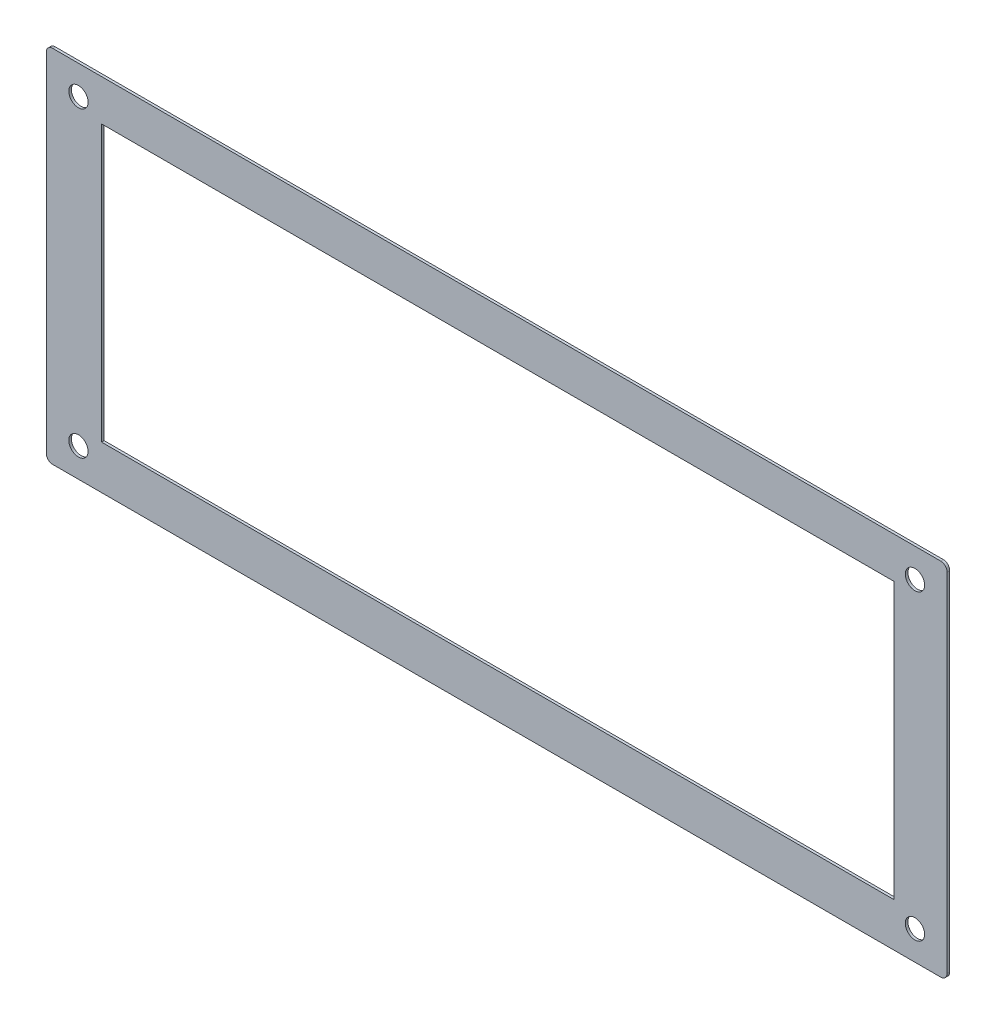
ISO-10303-21;
HEADER;
FILE_DESCRIPTION(('STEP AP214'),'2;1');
FILE_NAME('part.step','',(''),(''),'','','');
FILE_SCHEMA(('AUTOMOTIVE_DESIGN { 1 0 10303 214 1 1 1 1 }'));
ENDSEC;
DATA;
#1=APPLICATION_CONTEXT('core data for automotive mechanical design processes');
#2=APPLICATION_PROTOCOL_DEFINITION('international standard','automotive_design',2000,#1);
#3=PRODUCT_CONTEXT('',#1,'mechanical');
#4=PRODUCT('Part','Part','',(#3));
#5=PRODUCT_RELATED_PRODUCT_CATEGORY('part','',(#4));
#6=PRODUCT_DEFINITION_FORMATION('','',#4);
#7=PRODUCT_DEFINITION_CONTEXT('part definition',#1,'design');
#8=PRODUCT_DEFINITION('design','',#6,#7);
#9=PRODUCT_DEFINITION_SHAPE('','',#8);
#10=(LENGTH_UNIT() NAMED_UNIT(*) SI_UNIT(.MILLI.,.METRE.));
#11=(NAMED_UNIT(*) PLANE_ANGLE_UNIT() SI_UNIT($,.RADIAN.));
#12=(NAMED_UNIT(*) SI_UNIT($,.STERADIAN.) SOLID_ANGLE_UNIT());
#13=UNCERTAINTY_MEASURE_WITH_UNIT(LENGTH_MEASURE(1.E-05),#10,'distance_accuracy_value','');
#14=(GEOMETRIC_REPRESENTATION_CONTEXT(3) GLOBAL_UNCERTAINTY_ASSIGNED_CONTEXT((#13)) GLOBAL_UNIT_ASSIGNED_CONTEXT((#10,
#11,#12)) REPRESENTATION_CONTEXT('',''));
#15=CARTESIAN_POINT('',(0.,0.,0.));
#16=DIRECTION('',(0.,0.,1.));
#17=DIRECTION('',(1.,0.,0.));
#18=AXIS2_PLACEMENT_3D('',#15,#16,#17);
#19=CARTESIAN_POINT('',(1.,55.,-0.4));
#20=DIRECTION('',(0.,0.,1.));
#21=DIRECTION('',(1.,0.,0.));
#22=AXIS2_PLACEMENT_3D('',#19,#20,#21);
#23=CYLINDRICAL_SURFACE('',#22,1.);
#24=CARTESIAN_POINT('',(1.,55.,0.));
#25=DIRECTION('',(0.,0.,1.));
#26=DIRECTION('',(1.,0.,0.));
#27=AXIS2_PLACEMENT_3D('',#24,#25,#26);
#28=CIRCLE('',#27,1.);
#29=CARTESIAN_POINT('',(0.,55.,0.));
#30=VERTEX_POINT('',#29);
#31=CARTESIAN_POINT('',(1.00000000000001,56.,0.));
#32=VERTEX_POINT('',#31);
#33=EDGE_CURVE('E184',#30,#32,#28,.F.);
#34=ORIENTED_EDGE('',*,*,#33,.T.);
#35=DIRECTION('',(0.,0.,1.));
#36=VECTOR('',#35,1.);
#37=CARTESIAN_POINT('',(1.00000000000001,56.,-0.4));
#38=LINE('',#37,#36);
#39=CARTESIAN_POINT('',(1.00000000000001,56.,-0.4));
#40=VERTEX_POINT('',#39);
#41=EDGE_CURVE('E11',#40,#32,#38,.T.);
#42=ORIENTED_EDGE('',*,*,#41,.F.);
#43=CARTESIAN_POINT('',(1.,55.,-0.4));
#44=DIRECTION('',(0.,0.,1.));
#45=DIRECTION('',(1.,0.,0.));
#46=AXIS2_PLACEMENT_3D('',#43,#44,#45);
#47=CIRCLE('',#46,1.);
#48=CARTESIAN_POINT('',(0.,55.,-0.4));
#49=VERTEX_POINT('',#48);
#50=EDGE_CURVE('E258',#49,#40,#47,.F.);
#51=ORIENTED_EDGE('',*,*,#50,.F.);
#52=DIRECTION('',(0.,0.,1.));
#53=VECTOR('',#52,1.);
#54=CARTESIAN_POINT('',(0.,55.,-0.4));
#55=LINE('',#54,#53);
#56=EDGE_CURVE('E211',#49,#30,#55,.T.);
#57=ORIENTED_EDGE('',*,*,#56,.T.);
#58=EDGE_LOOP('',(#34,#42,#51,#57));
#59=FACE_BOUND('',#58,.T.);
#60=ADVANCED_FACE('F39',(#59),#23,.T.);
#61=CARTESIAN_POINT('',(0.,56.,-0.4));
#62=DIRECTION('',(0.,-1.,0.));
#63=DIRECTION('',(0.,0.,-1.));
#64=AXIS2_PLACEMENT_3D('',#61,#62,#63);
#65=PLANE('',#64);
#66=DIRECTION('',(1.,0.,0.));
#67=VECTOR('',#66,1.);
#68=CARTESIAN_POINT('',(0.,56.,0.));
#69=LINE('',#68,#67);
#70=CARTESIAN_POINT('',(139.,56.,0.));
#71=VERTEX_POINT('',#70);
#72=EDGE_CURVE('E95',#32,#71,#69,.T.);
#73=ORIENTED_EDGE('',*,*,#72,.T.);
#74=DIRECTION('',(0.,0.,1.));
#75=VECTOR('',#74,1.);
#76=CARTESIAN_POINT('',(139.,56.,-0.4));
#77=LINE('',#76,#75);
#78=CARTESIAN_POINT('',(139.,56.,-0.4));
#79=VERTEX_POINT('',#78);
#80=EDGE_CURVE('E49',#79,#71,#77,.T.);
#81=ORIENTED_EDGE('',*,*,#80,.F.);
#82=DIRECTION('',(1.,0.,0.));
#83=VECTOR('',#82,1.);
#84=CARTESIAN_POINT('',(0.,56.,-0.4));
#85=LINE('',#84,#83);
#86=EDGE_CURVE('E57',#40,#79,#85,.T.);
#87=ORIENTED_EDGE('',*,*,#86,.F.);
#88=ORIENTED_EDGE('',*,*,#41,.T.);
#89=EDGE_LOOP('',(#73,#81,#87,#88));
#90=FACE_BOUND('',#89,.T.);
#91=ADVANCED_FACE('F284',(#90),#65,.F.);
#92=CARTESIAN_POINT('',(139.,55.,-0.4));
#93=DIRECTION('',(0.,0.,1.));
#94=DIRECTION('',(1.,0.,0.));
#95=AXIS2_PLACEMENT_3D('',#92,#93,#94);
#96=CYLINDRICAL_SURFACE('',#95,1.);
#97=CARTESIAN_POINT('',(139.,55.,0.));
#98=DIRECTION('',(0.,0.,1.));
#99=DIRECTION('',(1.,0.,0.));
#100=AXIS2_PLACEMENT_3D('',#97,#98,#99);
#101=CIRCLE('',#100,1.);
#102=CARTESIAN_POINT('',(140.,55.,0.));
#103=VERTEX_POINT('',#102);
#104=EDGE_CURVE('E147',#71,#103,#101,.F.);
#105=ORIENTED_EDGE('',*,*,#104,.T.);
#106=DIRECTION('',(0.,0.,1.));
#107=VECTOR('',#106,1.);
#108=CARTESIAN_POINT('',(140.,55.,-0.4));
#109=LINE('',#108,#107);
#110=CARTESIAN_POINT('',(140.,55.,-0.4));
#111=VERTEX_POINT('',#110);
#112=EDGE_CURVE('E145',#111,#103,#109,.T.);
#113=ORIENTED_EDGE('',*,*,#112,.F.);
#114=CARTESIAN_POINT('',(139.,55.,-0.4));
#115=DIRECTION('',(0.,0.,1.));
#116=DIRECTION('',(1.,0.,0.));
#117=AXIS2_PLACEMENT_3D('',#114,#115,#116);
#118=CIRCLE('',#117,1.);
#119=EDGE_CURVE('E135',#79,#111,#118,.F.);
#120=ORIENTED_EDGE('',*,*,#119,.F.);
#121=ORIENTED_EDGE('',*,*,#80,.T.);
#122=EDGE_LOOP('',(#105,#113,#120,#121));
#123=FACE_BOUND('',#122,.T.);
#124=ADVANCED_FACE('F146',(#123),#96,.T.);
#125=CARTESIAN_POINT('',(140.,0.,-0.4));
#126=DIRECTION('',(1.,0.,0.));
#127=DIRECTION('',(0.,0.,-1.));
#128=AXIS2_PLACEMENT_3D('',#125,#126,#127);
#129=PLANE('',#128);
#130=DIRECTION('',(0.,1.,0.));
#131=VECTOR('',#130,1.);
#132=CARTESIAN_POINT('',(140.,0.,0.));
#133=LINE('',#132,#131);
#134=CARTESIAN_POINT('',(140.,1.00000000000001,0.));
#135=VERTEX_POINT('',#134);
#136=EDGE_CURVE('E197',#135,#103,#133,.T.);
#137=ORIENTED_EDGE('',*,*,#136,.F.);
#138=DIRECTION('',(0.,0.,1.));
#139=VECTOR('',#138,1.);
#140=CARTESIAN_POINT('',(140.,1.00000000000001,-0.4));
#141=LINE('',#140,#139);
#142=CARTESIAN_POINT('',(140.,1.00000000000001,-0.4));
#143=VERTEX_POINT('',#142);
#144=EDGE_CURVE('E151',#143,#135,#141,.T.);
#145=ORIENTED_EDGE('',*,*,#144,.F.);
#146=DIRECTION('',(0.,1.,0.));
#147=VECTOR('',#146,1.);
#148=CARTESIAN_POINT('',(140.,0.,-0.4));
#149=LINE('',#148,#147);
#150=EDGE_CURVE('E140',#143,#111,#149,.T.);
#151=ORIENTED_EDGE('',*,*,#150,.T.);
#152=ORIENTED_EDGE('',*,*,#112,.T.);
#153=EDGE_LOOP('',(#137,#145,#151,#152));
#154=FACE_BOUND('',#153,.T.);
#155=ADVANCED_FACE('F153',(#154),#129,.T.);
#156=CARTESIAN_POINT('',(139.,1.,-0.4));
#157=DIRECTION('',(0.,0.,1.));
#158=DIRECTION('',(1.,0.,0.));
#159=AXIS2_PLACEMENT_3D('',#156,#157,#158);
#160=CYLINDRICAL_SURFACE('',#159,1.);
#161=CARTESIAN_POINT('',(139.,1.,0.));
#162=DIRECTION('',(0.,0.,1.));
#163=DIRECTION('',(1.,0.,0.));
#164=AXIS2_PLACEMENT_3D('',#161,#162,#163);
#165=CIRCLE('',#164,1.);
#166=CARTESIAN_POINT('',(139.,0.,0.));
#167=VERTEX_POINT('',#166);
#168=EDGE_CURVE('E194',#167,#135,#165,.T.);
#169=ORIENTED_EDGE('',*,*,#168,.F.);
#170=DIRECTION('',(0.,0.,1.));
#171=VECTOR('',#170,1.);
#172=CARTESIAN_POINT('',(139.,0.,-0.4));
#173=LINE('',#172,#171);
#174=CARTESIAN_POINT('',(139.,0.,-0.4));
#175=VERTEX_POINT('',#174);
#176=EDGE_CURVE('E204',#175,#167,#173,.T.);
#177=ORIENTED_EDGE('',*,*,#176,.F.);
#178=CARTESIAN_POINT('',(139.,1.,-0.4));
#179=DIRECTION('',(0.,0.,1.));
#180=DIRECTION('',(1.,0.,0.));
#181=AXIS2_PLACEMENT_3D('',#178,#179,#180);
#182=CIRCLE('',#181,1.);
#183=EDGE_CURVE('E154',#175,#143,#182,.T.);
#184=ORIENTED_EDGE('',*,*,#183,.T.);
#185=ORIENTED_EDGE('',*,*,#144,.T.);
#186=EDGE_LOOP('',(#169,#177,#184,#185));
#187=FACE_BOUND('',#186,.T.);
#188=ADVANCED_FACE('F272',(#187),#160,.T.);
#189=CARTESIAN_POINT('',(0.,0.,-0.4));
#190=DIRECTION('',(0.,-1.,0.));
#191=DIRECTION('',(0.,0.,-1.));
#192=AXIS2_PLACEMENT_3D('',#189,#190,#191);
#193=PLANE('',#192);
#194=DIRECTION('',(1.,0.,0.));
#195=VECTOR('',#194,1.);
#196=CARTESIAN_POINT('',(0.,0.,0.));
#197=LINE('',#196,#195);
#198=CARTESIAN_POINT('',(1.00000000000001,0.,0.));
#199=VERTEX_POINT('',#198);
#200=EDGE_CURVE('E191',#199,#167,#197,.T.);
#201=ORIENTED_EDGE('',*,*,#200,.F.);
#202=DIRECTION('',(0.,0.,1.));
#203=VECTOR('',#202,1.);
#204=CARTESIAN_POINT('',(1.00000000000001,0.,-0.4));
#205=LINE('',#204,#203);
#206=CARTESIAN_POINT('',(1.00000000000001,0.,-0.4));
#207=VERTEX_POINT('',#206);
#208=EDGE_CURVE('E206',#207,#199,#205,.T.);
#209=ORIENTED_EDGE('',*,*,#208,.F.);
#210=DIRECTION('',(1.,0.,0.));
#211=VECTOR('',#210,1.);
#212=CARTESIAN_POINT('',(0.,0.,-0.4));
#213=LINE('',#212,#211);
#214=EDGE_CURVE('E156',#207,#175,#213,.T.);
#215=ORIENTED_EDGE('',*,*,#214,.T.);
#216=ORIENTED_EDGE('',*,*,#176,.T.);
#217=EDGE_LOOP('',(#201,#209,#215,#216));
#218=FACE_BOUND('',#217,.T.);
#219=ADVANCED_FACE('F267',(#218),#193,.T.);
#220=CARTESIAN_POINT('',(1.,1.,-0.4));
#221=DIRECTION('',(0.,0.,1.));
#222=DIRECTION('',(1.,0.,0.));
#223=AXIS2_PLACEMENT_3D('',#220,#221,#222);
#224=CYLINDRICAL_SURFACE('',#223,1.);
#225=CARTESIAN_POINT('',(1.,1.,0.));
#226=DIRECTION('',(0.,0.,1.));
#227=DIRECTION('',(1.,0.,0.));
#228=AXIS2_PLACEMENT_3D('',#225,#226,#227);
#229=CIRCLE('',#228,1.);
#230=CARTESIAN_POINT('',(0.,1.00000000000001,0.));
#231=VERTEX_POINT('',#230);
#232=EDGE_CURVE('E189',#199,#231,#229,.F.);
#233=ORIENTED_EDGE('',*,*,#232,.T.);
#234=DIRECTION('',(0.,0.,1.));
#235=VECTOR('',#234,1.);
#236=CARTESIAN_POINT('',(0.,1.00000000000001,-0.4));
#237=LINE('',#236,#235);
#238=CARTESIAN_POINT('',(0.,1.00000000000001,-0.4));
#239=VERTEX_POINT('',#238);
#240=EDGE_CURVE('E208',#239,#231,#237,.T.);
#241=ORIENTED_EDGE('',*,*,#240,.F.);
#242=CARTESIAN_POINT('',(1.,1.,-0.4));
#243=DIRECTION('',(0.,0.,1.));
#244=DIRECTION('',(1.,0.,0.));
#245=AXIS2_PLACEMENT_3D('',#242,#243,#244);
#246=CIRCLE('',#245,1.);
#247=EDGE_CURVE('E262',#207,#239,#246,.F.);
#248=ORIENTED_EDGE('',*,*,#247,.F.);
#249=ORIENTED_EDGE('',*,*,#208,.T.);
#250=EDGE_LOOP('',(#233,#241,#248,#249));
#251=FACE_BOUND('',#250,.T.);
#252=ADVANCED_FACE('F276',(#251),#224,.T.);
#253=CARTESIAN_POINT('',(0.,49.6331800410488,-0.4));
#254=DIRECTION('',(0.,-1.,0.));
#255=DIRECTION('',(0.,0.,-1.));
#256=AXIS2_PLACEMENT_3D('',#253,#254,#255);
#257=PLANE('',#256);
#258=DIRECTION('',(1.,0.,0.));
#259=VECTOR('',#258,1.);
#260=CARTESIAN_POINT('',(0.,49.6331800410488,0.));
#261=LINE('',#260,#259);
#262=CARTESIAN_POINT('',(8.60493923767081,49.6331800410488,0.));
#263=VERTEX_POINT('',#262);
#264=CARTESIAN_POINT('',(131.733794176967,49.6331800410488,0.));
#265=VERTEX_POINT('',#264);
#266=EDGE_CURVE('E161',#263,#265,#261,.T.);
#267=ORIENTED_EDGE('',*,*,#266,.F.);
#268=DIRECTION('',(0.,0.,1.));
#269=VECTOR('',#268,1.);
#270=CARTESIAN_POINT('',(8.60493923767081,49.6331800410488,-0.4));
#271=LINE('',#270,#269);
#272=CARTESIAN_POINT('',(8.60493923767081,49.6331800410488,-0.4));
#273=VERTEX_POINT('',#272);
#274=EDGE_CURVE('E214',#273,#263,#271,.T.);
#275=ORIENTED_EDGE('',*,*,#274,.F.);
#276=DIRECTION('',(1.,0.,0.));
#277=VECTOR('',#276,1.);
#278=CARTESIAN_POINT('',(0.,49.6331800410488,-0.4));
#279=LINE('',#278,#277);
#280=CARTESIAN_POINT('',(131.733794176967,49.6331800410488,-0.4));
#281=VERTEX_POINT('',#280);
#282=EDGE_CURVE('E200',#273,#281,#279,.T.);
#283=ORIENTED_EDGE('',*,*,#282,.T.);
#284=DIRECTION('',(0.,0.,1.));
#285=VECTOR('',#284,1.);
#286=CARTESIAN_POINT('',(131.733794176967,49.6331800410488,-0.4));
#287=LINE('',#286,#285);
#288=EDGE_CURVE('E43',#281,#265,#287,.T.);
#289=ORIENTED_EDGE('',*,*,#288,.T.);
#290=EDGE_LOOP('',(#267,#275,#283,#289));
#291=FACE_BOUND('',#290,.T.);
#292=ADVANCED_FACE('F41',(#291),#257,.T.);
#293=CARTESIAN_POINT('',(8.60493923767081,0.,-0.4));
#294=DIRECTION('',(-1.,0.,0.));
#295=DIRECTION('',(0.,0.,1.));
#296=AXIS2_PLACEMENT_3D('',#293,#294,#295);
#297=PLANE('',#296);
#298=DIRECTION('',(0.,-1.,0.));
#299=VECTOR('',#298,1.);
#300=CARTESIAN_POINT('',(8.60493923767081,0.,0.));
#301=LINE('',#300,#299);
#302=CARTESIAN_POINT('',(8.60493923767081,6.80275118310192,0.));
#303=VERTEX_POINT('',#302);
#304=EDGE_CURVE('E170',#263,#303,#301,.T.);
#305=ORIENTED_EDGE('',*,*,#304,.T.);
#306=DIRECTION('',(0.,0.,1.));
#307=VECTOR('',#306,1.);
#308=CARTESIAN_POINT('',(8.60493923767081,6.80275118310192,-0.4));
#309=LINE('',#308,#307);
#310=CARTESIAN_POINT('',(8.60493923767081,6.80275118310192,-0.4));
#311=VERTEX_POINT('',#310);
#312=EDGE_CURVE('E216',#311,#303,#309,.T.);
#313=ORIENTED_EDGE('',*,*,#312,.F.);
#314=DIRECTION('',(0.,-1.,0.));
#315=VECTOR('',#314,1.);
#316=CARTESIAN_POINT('',(8.60493923767081,0.,-0.4));
#317=LINE('',#316,#315);
#318=EDGE_CURVE('E239',#273,#311,#317,.T.);
#319=ORIENTED_EDGE('',*,*,#318,.F.);
#320=ORIENTED_EDGE('',*,*,#274,.T.);
#321=EDGE_LOOP('',(#305,#313,#319,#320));
#322=FACE_BOUND('',#321,.T.);
#323=ADVANCED_FACE('F232',(#322),#297,.F.);
#324=CARTESIAN_POINT('',(0.,6.80275118310192,-0.4));
#325=DIRECTION('',(0.,-1.,0.));
#326=DIRECTION('',(0.,0.,-1.));
#327=AXIS2_PLACEMENT_3D('',#324,#325,#326);
#328=PLANE('',#327);
#329=DIRECTION('',(1.,0.,0.));
#330=VECTOR('',#329,1.);
#331=CARTESIAN_POINT('',(0.,6.80275118310192,0.));
#332=LINE('',#331,#330);
#333=CARTESIAN_POINT('',(131.733794176967,6.80275118310192,0.));
#334=VERTEX_POINT('',#333);
#335=EDGE_CURVE('E167',#303,#334,#332,.T.);
#336=ORIENTED_EDGE('',*,*,#335,.T.);
#337=DIRECTION('',(0.,0.,1.));
#338=VECTOR('',#337,1.);
#339=CARTESIAN_POINT('',(131.733794176967,6.80275118310192,-0.4));
#340=LINE('',#339,#338);
#341=CARTESIAN_POINT('',(131.733794176967,6.80275118310192,-0.4));
#342=VERTEX_POINT('',#341);
#343=EDGE_CURVE('E218',#342,#334,#340,.T.);
#344=ORIENTED_EDGE('',*,*,#343,.F.);
#345=DIRECTION('',(1.,0.,0.));
#346=VECTOR('',#345,1.);
#347=CARTESIAN_POINT('',(0.,6.80275118310192,-0.4));
#348=LINE('',#347,#346);
#349=EDGE_CURVE('E237',#311,#342,#348,.T.);
#350=ORIENTED_EDGE('',*,*,#349,.F.);
#351=ORIENTED_EDGE('',*,*,#312,.T.);
#352=EDGE_LOOP('',(#336,#344,#350,#351));
#353=FACE_BOUND('',#352,.T.);
#354=ADVANCED_FACE('F236',(#353),#328,.F.);
#355=CARTESIAN_POINT('',(135.,51.5,-0.4));
#356=DIRECTION('',(0.,0.,1.));
#357=DIRECTION('',(1.,0.,0.));
#358=AXIS2_PLACEMENT_3D('',#355,#356,#357);
#359=CYLINDRICAL_SURFACE('',#358,1.50000000000003);
#360=CARTESIAN_POINT('',(135.,51.5,-0.4));
#361=DIRECTION('',(0.,0.,1.));
#362=DIRECTION('',(1.,0.,0.));
#363=AXIS2_PLACEMENT_3D('',#360,#361,#362);
#364=CIRCLE('',#363,1.50000000000003);
#365=CARTESIAN_POINT('',(136.5,51.5,-0.4));
#366=VERTEX_POINT('',#365);
#367=EDGE_CURVE('E255',#366,#366,#364,.T.);
#368=ORIENTED_EDGE('',*,*,#367,.F.);
#369=EDGE_LOOP('',(#368));
#370=FACE_BOUND('',#369,.T.);
#371=CARTESIAN_POINT('',(135.,51.5,0.));
#372=DIRECTION('',(0.,0.,1.));
#373=DIRECTION('',(1.,0.,0.));
#374=AXIS2_PLACEMENT_3D('',#371,#372,#373);
#375=CIRCLE('',#374,1.50000000000003);
#376=CARTESIAN_POINT('',(136.5,51.5,0.));
#377=VERTEX_POINT('',#376);
#378=EDGE_CURVE('E181',#377,#377,#375,.T.);
#379=ORIENTED_EDGE('',*,*,#378,.T.);
#380=EDGE_LOOP('',(#379));
#381=FACE_BOUND('',#380,.T.);
#382=ADVANCED_FACE('F306',(#370,#381),#359,.F.);
#383=CARTESIAN_POINT('',(135.,4.49999999999996,-0.4));
#384=DIRECTION('',(0.,0.,1.));
#385=DIRECTION('',(1.,0.,0.));
#386=AXIS2_PLACEMENT_3D('',#383,#384,#385);
#387=CYLINDRICAL_SURFACE('',#386,1.50000000000003);
#388=CARTESIAN_POINT('',(135.,4.49999999999996,-0.4));
#389=DIRECTION('',(0.,0.,1.));
#390=DIRECTION('',(1.,0.,0.));
#391=AXIS2_PLACEMENT_3D('',#388,#389,#390);
#392=CIRCLE('',#391,1.50000000000003);
#393=CARTESIAN_POINT('',(136.5,4.49999999999996,-0.4));
#394=VERTEX_POINT('',#393);
#395=EDGE_CURVE('E252',#394,#394,#392,.T.);
#396=ORIENTED_EDGE('',*,*,#395,.F.);
#397=EDGE_LOOP('',(#396));
#398=FACE_BOUND('',#397,.T.);
#399=CARTESIAN_POINT('',(135.,4.49999999999996,0.));
#400=DIRECTION('',(0.,0.,1.));
#401=DIRECTION('',(1.,0.,0.));
#402=AXIS2_PLACEMENT_3D('',#399,#400,#401);
#403=CIRCLE('',#402,1.50000000000003);
#404=CARTESIAN_POINT('',(136.5,4.49999999999996,0.));
#405=VERTEX_POINT('',#404);
#406=EDGE_CURVE('E178',#405,#405,#403,.T.);
#407=ORIENTED_EDGE('',*,*,#406,.T.);
#408=EDGE_LOOP('',(#407));
#409=FACE_BOUND('',#408,.T.);
#410=ADVANCED_FACE('F309',(#398,#409),#387,.F.);
#411=CARTESIAN_POINT('',(5.00000000000001,4.50000000000001,-0.4));
#412=DIRECTION('',(0.,0.,1.));
#413=DIRECTION('',(1.,0.,0.));
#414=AXIS2_PLACEMENT_3D('',#411,#412,#413);
#415=CYLINDRICAL_SURFACE('',#414,1.5);
#416=CARTESIAN_POINT('',(5.00000000000001,4.50000000000001,-0.4));
#417=DIRECTION('',(0.,0.,1.));
#418=DIRECTION('',(1.,0.,0.));
#419=AXIS2_PLACEMENT_3D('',#416,#417,#418);
#420=CIRCLE('',#419,1.5);
#421=CARTESIAN_POINT('',(6.50000000000001,4.50000000000001,-0.4));
#422=VERTEX_POINT('',#421);
#423=EDGE_CURVE('E249',#422,#422,#420,.T.);
#424=ORIENTED_EDGE('',*,*,#423,.F.);
#425=EDGE_LOOP('',(#424));
#426=FACE_BOUND('',#425,.T.);
#427=CARTESIAN_POINT('',(5.00000000000001,4.50000000000001,0.));
#428=DIRECTION('',(0.,0.,1.));
#429=DIRECTION('',(1.,0.,0.));
#430=AXIS2_PLACEMENT_3D('',#427,#428,#429);
#431=CIRCLE('',#430,1.5);
#432=CARTESIAN_POINT('',(6.50000000000001,4.50000000000001,0.));
#433=VERTEX_POINT('',#432);
#434=EDGE_CURVE('E175',#433,#433,#431,.T.);
#435=ORIENTED_EDGE('',*,*,#434,.T.);
#436=EDGE_LOOP('',(#435));
#437=FACE_BOUND('',#436,.T.);
#438=ADVANCED_FACE('F313',(#426,#437),#415,.F.);
#439=CARTESIAN_POINT('',(5.00000000000001,51.5,-0.4));
#440=DIRECTION('',(0.,0.,1.));
#441=DIRECTION('',(1.,0.,0.));
#442=AXIS2_PLACEMENT_3D('',#439,#440,#441);
#443=CYLINDRICAL_SURFACE('',#442,1.5);
#444=CARTESIAN_POINT('',(5.00000000000001,51.5,-0.4));
#445=DIRECTION('',(0.,0.,1.));
#446=DIRECTION('',(1.,0.,0.));
#447=AXIS2_PLACEMENT_3D('',#444,#445,#446);
#448=CIRCLE('',#447,1.5);
#449=CARTESIAN_POINT('',(6.50000000000001,51.5,-0.4));
#450=VERTEX_POINT('',#449);
#451=EDGE_CURVE('E242',#450,#450,#448,.T.);
#452=ORIENTED_EDGE('',*,*,#451,.F.);
#453=EDGE_LOOP('',(#452));
#454=FACE_BOUND('',#453,.T.);
#455=CARTESIAN_POINT('',(5.00000000000001,51.5,0.));
#456=DIRECTION('',(0.,0.,1.));
#457=DIRECTION('',(1.,0.,0.));
#458=AXIS2_PLACEMENT_3D('',#455,#456,#457);
#459=CIRCLE('',#458,1.5);
#460=CARTESIAN_POINT('',(6.50000000000001,51.5,0.));
#461=VERTEX_POINT('',#460);
#462=EDGE_CURVE('E172',#461,#461,#459,.T.);
#463=ORIENTED_EDGE('',*,*,#462,.T.);
#464=EDGE_LOOP('',(#463));
#465=FACE_BOUND('',#464,.T.);
#466=ADVANCED_FACE('F317',(#454,#465),#443,.F.);
#467=CARTESIAN_POINT('',(131.733794176967,0.,-0.4));
#468=DIRECTION('',(-1.,0.,0.));
#469=DIRECTION('',(0.,0.,1.));
#470=AXIS2_PLACEMENT_3D('',#467,#468,#469);
#471=PLANE('',#470);
#472=DIRECTION('',(0.,-1.,0.));
#473=VECTOR('',#472,1.);
#474=CARTESIAN_POINT('',(131.733794176967,0.,0.));
#475=LINE('',#474,#473);
#476=EDGE_CURVE('E164',#265,#334,#475,.T.);
#477=ORIENTED_EDGE('',*,*,#476,.F.);
#478=ORIENTED_EDGE('',*,*,#288,.F.);
#479=DIRECTION('',(0.,-1.,0.));
#480=VECTOR('',#479,1.);
#481=CARTESIAN_POINT('',(131.733794176967,0.,-0.4));
#482=LINE('',#481,#480);
#483=EDGE_CURVE('E240',#281,#342,#482,.T.);
#484=ORIENTED_EDGE('',*,*,#483,.T.);
#485=ORIENTED_EDGE('',*,*,#343,.T.);
#486=EDGE_LOOP('',(#477,#478,#484,#485));
#487=FACE_BOUND('',#486,.T.);
#488=ADVANCED_FACE('F224',(#487),#471,.T.);
#489=CARTESIAN_POINT('',(0.,0.,-0.4));
#490=DIRECTION('',(1.,0.,0.));
#491=DIRECTION('',(0.,0.,-1.));
#492=AXIS2_PLACEMENT_3D('',#489,#490,#491);
#493=PLANE('',#492);
#494=DIRECTION('',(0.,1.,0.));
#495=VECTOR('',#494,1.);
#496=CARTESIAN_POINT('',(0.,0.,0.));
#497=LINE('',#496,#495);
#498=EDGE_CURVE('E187',#231,#30,#497,.T.);
#499=ORIENTED_EDGE('',*,*,#498,.T.);
#500=ORIENTED_EDGE('',*,*,#56,.F.);
#501=DIRECTION('',(0.,1.,0.));
#502=VECTOR('',#501,1.);
#503=CARTESIAN_POINT('',(0.,0.,-0.4));
#504=LINE('',#503,#502);
#505=EDGE_CURVE('E260',#239,#49,#504,.T.);
#506=ORIENTED_EDGE('',*,*,#505,.F.);
#507=ORIENTED_EDGE('',*,*,#240,.T.);
#508=EDGE_LOOP('',(#499,#500,#506,#507));
#509=FACE_BOUND('',#508,.T.);
#510=ADVANCED_FACE('F279',(#509),#493,.F.);
#511=CARTESIAN_POINT('',(0.,0.,-0.4));
#512=DIRECTION('',(0.,0.,1.));
#513=DIRECTION('',(1.,0.,0.));
#514=AXIS2_PLACEMENT_3D('',#511,#512,#513);
#515=PLANE('',#514);
#516=ORIENTED_EDGE('',*,*,#282,.F.);
#517=ORIENTED_EDGE('',*,*,#318,.T.);
#518=ORIENTED_EDGE('',*,*,#349,.T.);
#519=ORIENTED_EDGE('',*,*,#483,.F.);
#520=EDGE_LOOP('',(#516,#517,#518,#519));
#521=FACE_BOUND('',#520,.T.);
#522=ORIENTED_EDGE('',*,*,#451,.T.);
#523=EDGE_LOOP('',(#522));
#524=FACE_BOUND('',#523,.T.);
#525=ORIENTED_EDGE('',*,*,#423,.T.);
#526=EDGE_LOOP('',(#525));
#527=FACE_BOUND('',#526,.T.);
#528=ORIENTED_EDGE('',*,*,#395,.T.);
#529=EDGE_LOOP('',(#528));
#530=FACE_BOUND('',#529,.T.);
#531=ORIENTED_EDGE('',*,*,#367,.T.);
#532=EDGE_LOOP('',(#531));
#533=FACE_BOUND('',#532,.T.);
#534=ORIENTED_EDGE('',*,*,#50,.T.);
#535=ORIENTED_EDGE('',*,*,#86,.T.);
#536=ORIENTED_EDGE('',*,*,#119,.T.);
#537=ORIENTED_EDGE('',*,*,#150,.F.);
#538=ORIENTED_EDGE('',*,*,#183,.F.);
#539=ORIENTED_EDGE('',*,*,#214,.F.);
#540=ORIENTED_EDGE('',*,*,#247,.T.);
#541=ORIENTED_EDGE('',*,*,#505,.T.);
#542=EDGE_LOOP('',(#534,#535,#536,#537,#538,#539,#540,#541));
#543=FACE_BOUND('',#542,.T.);
#544=ADVANCED_FACE('F137',(#521,#524,#527,#530,#533,#543),#515,.F.);
#545=CARTESIAN_POINT('',(0.,0.,0.));
#546=DIRECTION('',(0.,0.,1.));
#547=DIRECTION('',(1.,0.,0.));
#548=AXIS2_PLACEMENT_3D('',#545,#546,#547);
#549=PLANE('',#548);
#550=ORIENTED_EDGE('',*,*,#266,.T.);
#551=ORIENTED_EDGE('',*,*,#476,.T.);
#552=ORIENTED_EDGE('',*,*,#335,.F.);
#553=ORIENTED_EDGE('',*,*,#304,.F.);
#554=EDGE_LOOP('',(#550,#551,#552,#553));
#555=FACE_BOUND('',#554,.T.);
#556=ORIENTED_EDGE('',*,*,#462,.F.);
#557=EDGE_LOOP('',(#556));
#558=FACE_BOUND('',#557,.T.);
#559=ORIENTED_EDGE('',*,*,#434,.F.);
#560=EDGE_LOOP('',(#559));
#561=FACE_BOUND('',#560,.T.);
#562=ORIENTED_EDGE('',*,*,#406,.F.);
#563=EDGE_LOOP('',(#562));
#564=FACE_BOUND('',#563,.T.);
#565=ORIENTED_EDGE('',*,*,#378,.F.);
#566=EDGE_LOOP('',(#565));
#567=FACE_BOUND('',#566,.T.);
#568=ORIENTED_EDGE('',*,*,#33,.F.);
#569=ORIENTED_EDGE('',*,*,#498,.F.);
#570=ORIENTED_EDGE('',*,*,#232,.F.);
#571=ORIENTED_EDGE('',*,*,#200,.T.);
#572=ORIENTED_EDGE('',*,*,#168,.T.);
#573=ORIENTED_EDGE('',*,*,#136,.T.);
#574=ORIENTED_EDGE('',*,*,#104,.F.);
#575=ORIENTED_EDGE('',*,*,#72,.F.);
#576=EDGE_LOOP('',(#568,#569,#570,#571,#572,#573,#574,#575));
#577=FACE_BOUND('',#576,.T.);
#578=ADVANCED_FACE('F228',(#555,#558,#561,#564,#567,#577),#549,.T.);
#579=CLOSED_SHELL('',(#60,#91,#124,#155,#188,#219,#252,#292,#323,#354,#382,#410,#438,#466,#488,
#510,#544,#578));
#580=MANIFOLD_SOLID_BREP('B2',#579);
#581=ADVANCED_BREP_SHAPE_REPRESENTATION('',(#18,#580),#14);
#582=SHAPE_DEFINITION_REPRESENTATION(#9,#581);
ENDSEC;
END-ISO-10303-21;
